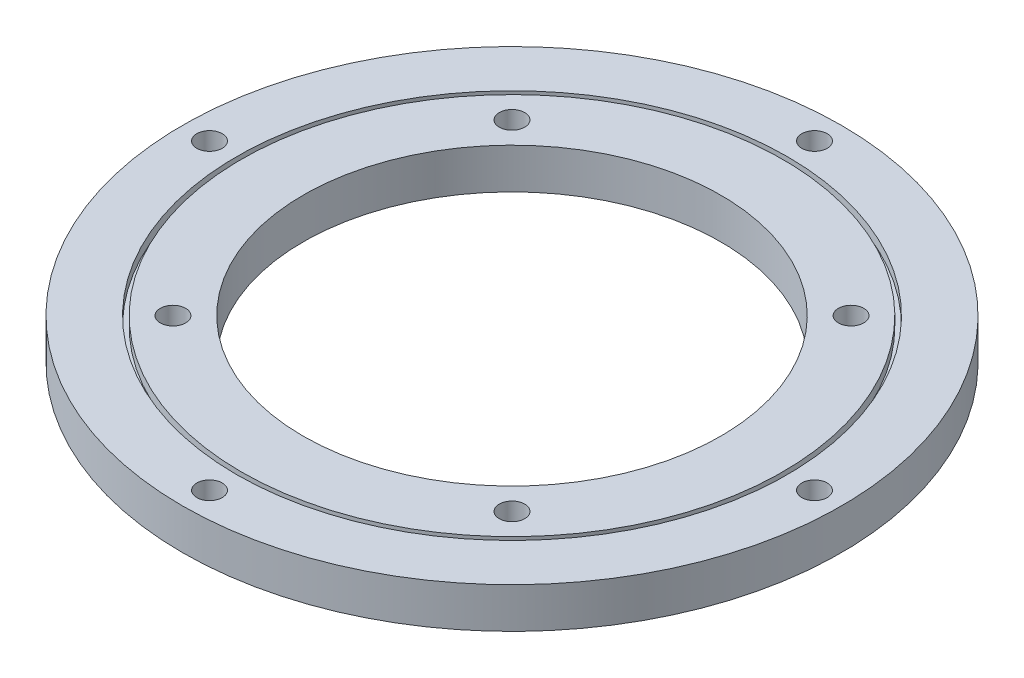
ISO-10303-21;
HEADER;
FILE_DESCRIPTION(('STEP AP214'),'2;1');
FILE_NAME('part.step','',(''),(''),'','','');
FILE_SCHEMA(('AUTOMOTIVE_DESIGN { 1 0 10303 214 1 1 1 1 }'));
ENDSEC;
DATA;
#1=APPLICATION_CONTEXT('core data for automotive mechanical design processes');
#2=APPLICATION_PROTOCOL_DEFINITION('international standard','automotive_design',2000,#1);
#3=PRODUCT_CONTEXT('',#1,'mechanical');
#4=PRODUCT('Part','Part','',(#3));
#5=PRODUCT_RELATED_PRODUCT_CATEGORY('part','',(#4));
#6=PRODUCT_DEFINITION_FORMATION('','',#4);
#7=PRODUCT_DEFINITION_CONTEXT('part definition',#1,'design');
#8=PRODUCT_DEFINITION('design','',#6,#7);
#9=PRODUCT_DEFINITION_SHAPE('','',#8);
#10=(LENGTH_UNIT() NAMED_UNIT(*) SI_UNIT(.MILLI.,.METRE.));
#11=(NAMED_UNIT(*) PLANE_ANGLE_UNIT() SI_UNIT($,.RADIAN.));
#12=(NAMED_UNIT(*) SI_UNIT($,.STERADIAN.) SOLID_ANGLE_UNIT());
#13=UNCERTAINTY_MEASURE_WITH_UNIT(LENGTH_MEASURE(1.E-05),#10,'distance_accuracy_value','');
#14=(GEOMETRIC_REPRESENTATION_CONTEXT(3) GLOBAL_UNCERTAINTY_ASSIGNED_CONTEXT((#13)) GLOBAL_UNIT_ASSIGNED_CONTEXT((#10,
#11,#12)) REPRESENTATION_CONTEXT('',''));
#15=CARTESIAN_POINT('',(0.,0.,0.));
#16=DIRECTION('',(0.,0.,1.));
#17=DIRECTION('',(1.,0.,0.));
#18=AXIS2_PLACEMENT_3D('',#15,#16,#17);
#19=CARTESIAN_POINT('',(0.,0.,0.));
#20=DIRECTION('',(0.,1.,0.));
#21=DIRECTION('',(0.,0.,1.));
#22=AXIS2_PLACEMENT_3D('',#19,#20,#21);
#23=PLANE('',#22);
#24=CARTESIAN_POINT('',(-36.0094128319228,0.,36.009412831925));
#25=DIRECTION('',(0.,1.,0.));
#26=DIRECTION('',(0.,0.,1.));
#27=AXIS2_PLACEMENT_3D('',#24,#25,#26);
#28=CIRCLE('',#27,2.70000000000106);
#29=CARTESIAN_POINT('',(-36.0094128319228,0.,38.7094128319261));
#30=VERTEX_POINT('',#29);
#31=EDGE_CURVE('E115',#30,#30,#28,.T.);
#32=ORIENTED_EDGE('',*,*,#31,.T.);
#33=EDGE_LOOP('',(#32));
#34=FACE_BOUND('',#33,.T.);
#35=CARTESIAN_POINT('',(36.009412831927,0.,36.0094128319229));
#36=DIRECTION('',(0.,1.,0.));
#37=DIRECTION('',(0.,0.,1.));
#38=AXIS2_PLACEMENT_3D('',#35,#36,#37);
#39=CIRCLE('',#38,2.70000000000282);
#40=CARTESIAN_POINT('',(36.009412831927,0.,38.7094128319257));
#41=VERTEX_POINT('',#40);
#42=EDGE_CURVE('E121',#41,#41,#39,.T.);
#43=ORIENTED_EDGE('',*,*,#42,.T.);
#44=EDGE_LOOP('',(#43));
#45=FACE_BOUND('',#44,.T.);
#46=CARTESIAN_POINT('',(36.0094128319249,0.,-36.009412831927));
#47=DIRECTION('',(0.,1.,0.));
#48=DIRECTION('',(0.,0.,1.));
#49=AXIS2_PLACEMENT_3D('',#46,#47,#48);
#50=CIRCLE('',#49,2.70000000000207);
#51=CARTESIAN_POINT('',(36.0094128319249,0.,-33.3094128319249));
#52=VERTEX_POINT('',#51);
#53=EDGE_CURVE('E127',#52,#52,#50,.T.);
#54=ORIENTED_EDGE('',*,*,#53,.T.);
#55=EDGE_LOOP('',(#54));
#56=FACE_BOUND('',#55,.T.);
#57=CARTESIAN_POINT('',(-36.009412831925,0.,-36.0094128319249));
#58=DIRECTION('',(0.,1.,0.));
#59=DIRECTION('',(0.,0.,1.));
#60=AXIS2_PLACEMENT_3D('',#57,#58,#59);
#61=CIRCLE('',#60,2.7);
#62=CARTESIAN_POINT('',(-36.009412831925,0.,-33.3094128319249));
#63=VERTEX_POINT('',#62);
#64=EDGE_CURVE('E89',#63,#63,#61,.T.);
#65=ORIENTED_EDGE('',*,*,#64,.T.);
#66=EDGE_LOOP('',(#65));
#67=FACE_BOUND('',#66,.T.);
#68=CARTESIAN_POINT('',(0.,0.,0.));
#69=DIRECTION('',(0.,1.,0.));
#70=DIRECTION('',(0.,0.,1.));
#71=AXIS2_PLACEMENT_3D('',#68,#69,#70);
#72=CIRCLE('',#71,44.35);
#73=CARTESIAN_POINT('',(0.,0.,44.35));
#74=VERTEX_POINT('',#73);
#75=EDGE_CURVE('E55',#74,#74,#72,.T.);
#76=ORIENTED_EDGE('',*,*,#75,.T.);
#77=EDGE_LOOP('',(#76));
#78=FACE_BOUND('',#77,.T.);
#79=CARTESIAN_POINT('',(0.,0.,0.));
#80=DIRECTION('',(0.,1.,0.));
#81=DIRECTION('',(0.,0.,1.));
#82=AXIS2_PLACEMENT_3D('',#79,#80,#81);
#83=CIRCLE('',#82,57.5);
#84=CARTESIAN_POINT('',(0.,0.,57.5));
#85=VERTEX_POINT('',#84);
#86=EDGE_CURVE('E79',#85,#85,#83,.T.);
#87=ORIENTED_EDGE('',*,*,#86,.F.);
#88=EDGE_LOOP('',(#87));
#89=FACE_BOUND('',#88,.T.);
#90=ADVANCED_FACE('F42',(#34,#45,#56,#67,#78,#89),#23,.F.);
#91=CARTESIAN_POINT('',(0.,8.6,0.));
#92=DIRECTION('',(0.,1.,0.));
#93=DIRECTION('',(0.,0.,1.));
#94=AXIS2_PLACEMENT_3D('',#91,#92,#93);
#95=PLANE('',#94);
#96=CARTESIAN_POINT('',(-36.0094128319228,8.6,36.009412831925));
#97=DIRECTION('',(0.,1.,0.));
#98=DIRECTION('',(0.,0.,1.));
#99=AXIS2_PLACEMENT_3D('',#96,#97,#98);
#100=CIRCLE('',#99,2.70000000000106);
#101=CARTESIAN_POINT('',(-36.0094128319228,8.6,38.7094128319261));
#102=VERTEX_POINT('',#101);
#103=EDGE_CURVE('E118',#102,#102,#100,.T.);
#104=ORIENTED_EDGE('',*,*,#103,.F.);
#105=EDGE_LOOP('',(#104));
#106=FACE_BOUND('',#105,.T.);
#107=CARTESIAN_POINT('',(36.009412831927,8.6,36.0094128319229));
#108=DIRECTION('',(0.,1.,0.));
#109=DIRECTION('',(0.,0.,1.));
#110=AXIS2_PLACEMENT_3D('',#107,#108,#109);
#111=CIRCLE('',#110,2.70000000000282);
#112=CARTESIAN_POINT('',(36.009412831927,8.6,38.7094128319257));
#113=VERTEX_POINT('',#112);
#114=EDGE_CURVE('E124',#113,#113,#111,.T.);
#115=ORIENTED_EDGE('',*,*,#114,.F.);
#116=EDGE_LOOP('',(#115));
#117=FACE_BOUND('',#116,.T.);
#118=CARTESIAN_POINT('',(36.0094128319249,8.6,-36.009412831927));
#119=DIRECTION('',(0.,1.,0.));
#120=DIRECTION('',(0.,0.,1.));
#121=AXIS2_PLACEMENT_3D('',#118,#119,#120);
#122=CIRCLE('',#121,2.70000000000207);
#123=CARTESIAN_POINT('',(36.0094128319249,8.6,-33.3094128319249));
#124=VERTEX_POINT('',#123);
#125=EDGE_CURVE('E112',#124,#124,#122,.T.);
#126=ORIENTED_EDGE('',*,*,#125,.F.);
#127=EDGE_LOOP('',(#126));
#128=FACE_BOUND('',#127,.T.);
#129=CARTESIAN_POINT('',(-36.009412831925,8.6,-36.0094128319249));
#130=DIRECTION('',(0.,1.,0.));
#131=DIRECTION('',(0.,0.,1.));
#132=AXIS2_PLACEMENT_3D('',#129,#130,#131);
#133=CIRCLE('',#132,2.7);
#134=CARTESIAN_POINT('',(-36.009412831925,8.6,-33.3094128319249));
#135=VERTEX_POINT('',#134);
#136=EDGE_CURVE('E109',#135,#135,#133,.T.);
#137=ORIENTED_EDGE('',*,*,#136,.F.);
#138=EDGE_LOOP('',(#137));
#139=FACE_BOUND('',#138,.T.);
#140=CARTESIAN_POINT('',(0.,8.6,0.));
#141=DIRECTION('',(0.,1.,0.));
#142=DIRECTION('',(0.,0.,1.));
#143=AXIS2_PLACEMENT_3D('',#140,#141,#142);
#144=CIRCLE('',#143,44.35);
#145=CARTESIAN_POINT('',(0.,8.6,44.35));
#146=VERTEX_POINT('',#145);
#147=EDGE_CURVE('E53',#146,#146,#144,.T.);
#148=ORIENTED_EDGE('',*,*,#147,.F.);
#149=EDGE_LOOP('',(#148));
#150=FACE_BOUND('',#149,.T.);
#151=CARTESIAN_POINT('',(0.,8.6,0.));
#152=DIRECTION('',(0.,1.,0.));
#153=DIRECTION('',(0.,0.,1.));
#154=AXIS2_PLACEMENT_3D('',#151,#152,#153);
#155=CIRCLE('',#154,57.5);
#156=CARTESIAN_POINT('',(0.,8.6,57.5));
#157=VERTEX_POINT('',#156);
#158=EDGE_CURVE('E67',#157,#157,#155,.T.);
#159=ORIENTED_EDGE('',*,*,#158,.T.);
#160=EDGE_LOOP('',(#159));
#161=FACE_BOUND('',#160,.T.);
#162=ADVANCED_FACE('F135',(#106,#117,#128,#139,#150,#161),#95,.T.);
#163=CARTESIAN_POINT('',(0.,8.6,-64.25));
#164=DIRECTION('',(0.,1.,0.));
#165=DIRECTION('',(0.,0.,1.));
#166=AXIS2_PLACEMENT_3D('',#163,#164,#165);
#167=CIRCLE('',#166,2.7);
#168=CARTESIAN_POINT('',(0.,8.6,-61.55));
#169=VERTEX_POINT('',#168);
#170=EDGE_CURVE('E104',#169,#169,#167,.T.);
#171=ORIENTED_EDGE('',*,*,#170,.F.);
#172=EDGE_LOOP('',(#171));
#173=FACE_BOUND('',#172,.T.);
#174=CARTESIAN_POINT('',(64.2500000000018,8.6,-1.81358812546716E-12));
#175=DIRECTION('',(0.,1.,0.));
#176=DIRECTION('',(0.,0.,1.));
#177=AXIS2_PLACEMENT_3D('',#174,#175,#176);
#178=CIRCLE('',#177,2.70000000000141);
#179=CARTESIAN_POINT('',(64.2500000000018,8.6,2.6999999999996));
#180=VERTEX_POINT('',#179);
#181=EDGE_CURVE('E101',#180,#180,#178,.T.);
#182=ORIENTED_EDGE('',*,*,#181,.F.);
#183=EDGE_LOOP('',(#182));
#184=FACE_BOUND('',#183,.T.);
#185=CARTESIAN_POINT('',(3.62788042284384E-12,8.6,64.25));
#186=DIRECTION('',(0.,1.,0.));
#187=DIRECTION('',(0.,0.,1.));
#188=AXIS2_PLACEMENT_3D('',#185,#186,#187);
#189=CIRCLE('',#188,2.7000000000039);
#190=CARTESIAN_POINT('',(3.62788042284384E-12,8.6,66.9500000000039));
#191=VERTEX_POINT('',#190);
#192=EDGE_CURVE('E95',#191,#191,#189,.T.);
#193=ORIENTED_EDGE('',*,*,#192,.F.);
#194=EDGE_LOOP('',(#193));
#195=FACE_BOUND('',#194,.T.);
#196=CARTESIAN_POINT('',(-64.2499999999982,8.6,1.82145648115169E-12));
#197=DIRECTION('',(0.,1.,0.));
#198=DIRECTION('',(0.,0.,1.));
#199=AXIS2_PLACEMENT_3D('',#196,#197,#198);
#200=CIRCLE('',#199,2.70000000000291);
#201=CARTESIAN_POINT('',(-64.2499999999982,8.6,2.70000000000473));
#202=VERTEX_POINT('',#201);
#203=EDGE_CURVE('E88',#202,#202,#200,.T.);
#204=ORIENTED_EDGE('',*,*,#203,.F.);
#205=EDGE_LOOP('',(#204));
#206=FACE_BOUND('',#205,.T.);
#207=CARTESIAN_POINT('',(0.,8.6,0.));
#208=DIRECTION('',(0.,1.,0.));
#209=DIRECTION('',(0.,0.,1.));
#210=AXIS2_PLACEMENT_3D('',#207,#208,#209);
#211=CIRCLE('',#210,58.5);
#212=CARTESIAN_POINT('',(0.,8.6,58.5));
#213=VERTEX_POINT('',#212);
#214=EDGE_CURVE('E61',#213,#213,#211,.T.);
#215=ORIENTED_EDGE('',*,*,#214,.F.);
#216=EDGE_LOOP('',(#215));
#217=FACE_BOUND('',#216,.T.);
#218=CARTESIAN_POINT('',(0.,8.6,0.));
#219=DIRECTION('',(0.,1.,0.));
#220=DIRECTION('',(0.,0.,1.));
#221=AXIS2_PLACEMENT_3D('',#218,#219,#220);
#222=CIRCLE('',#221,70.);
#223=CARTESIAN_POINT('',(0.,8.6,70.));
#224=VERTEX_POINT('',#223);
#225=EDGE_CURVE('E10',#224,#224,#222,.T.);
#226=ORIENTED_EDGE('',*,*,#225,.T.);
#227=EDGE_LOOP('',(#226));
#228=FACE_BOUND('',#227,.T.);
#229=ADVANCED_FACE('F138',(#173,#184,#195,#206,#217,#228),#95,.T.);
#230=CARTESIAN_POINT('',(0.,0.,-64.25));
#231=DIRECTION('',(0.,1.,0.));
#232=DIRECTION('',(0.,0.,1.));
#233=AXIS2_PLACEMENT_3D('',#230,#231,#232);
#234=CIRCLE('',#233,2.7);
#235=CARTESIAN_POINT('',(0.,0.,-61.55));
#236=VERTEX_POINT('',#235);
#237=EDGE_CURVE('E82',#236,#236,#234,.T.);
#238=ORIENTED_EDGE('',*,*,#237,.T.);
#239=EDGE_LOOP('',(#238));
#240=FACE_BOUND('',#239,.T.);
#241=CARTESIAN_POINT('',(64.2500000000018,0.,-1.81358812546716E-12));
#242=DIRECTION('',(0.,1.,0.));
#243=DIRECTION('',(0.,0.,1.));
#244=AXIS2_PLACEMENT_3D('',#241,#242,#243);
#245=CIRCLE('',#244,2.70000000000141);
#246=CARTESIAN_POINT('',(64.2500000000018,0.,2.6999999999996));
#247=VERTEX_POINT('',#246);
#248=EDGE_CURVE('E98',#247,#247,#245,.T.);
#249=ORIENTED_EDGE('',*,*,#248,.T.);
#250=EDGE_LOOP('',(#249));
#251=FACE_BOUND('',#250,.T.);
#252=CARTESIAN_POINT('',(3.62788042284384E-12,0.,64.25));
#253=DIRECTION('',(0.,1.,0.));
#254=DIRECTION('',(0.,0.,1.));
#255=AXIS2_PLACEMENT_3D('',#252,#253,#254);
#256=CIRCLE('',#255,2.7000000000039);
#257=CARTESIAN_POINT('',(3.62788042284384E-12,0.,66.9500000000039));
#258=VERTEX_POINT('',#257);
#259=EDGE_CURVE('E92',#258,#258,#256,.T.);
#260=ORIENTED_EDGE('',*,*,#259,.T.);
#261=EDGE_LOOP('',(#260));
#262=FACE_BOUND('',#261,.T.);
#263=CARTESIAN_POINT('',(-64.2499999999982,0.,1.82145648115169E-12));
#264=DIRECTION('',(0.,1.,0.));
#265=DIRECTION('',(0.,0.,1.));
#266=AXIS2_PLACEMENT_3D('',#263,#264,#265);
#267=CIRCLE('',#266,2.70000000000291);
#268=CARTESIAN_POINT('',(-64.2499999999982,0.,2.70000000000473));
#269=VERTEX_POINT('',#268);
#270=EDGE_CURVE('E85',#269,#269,#267,.T.);
#271=ORIENTED_EDGE('',*,*,#270,.T.);
#272=EDGE_LOOP('',(#271));
#273=FACE_BOUND('',#272,.T.);
#274=CARTESIAN_POINT('',(0.,0.,0.));
#275=DIRECTION('',(0.,1.,0.));
#276=DIRECTION('',(0.,0.,1.));
#277=AXIS2_PLACEMENT_3D('',#274,#275,#276);
#278=CIRCLE('',#277,58.5);
#279=CARTESIAN_POINT('',(0.,0.,58.5));
#280=VERTEX_POINT('',#279);
#281=EDGE_CURVE('E73',#280,#280,#278,.T.);
#282=ORIENTED_EDGE('',*,*,#281,.T.);
#283=EDGE_LOOP('',(#282));
#284=FACE_BOUND('',#283,.T.);
#285=CARTESIAN_POINT('',(0.,0.,0.));
#286=DIRECTION('',(0.,1.,0.));
#287=DIRECTION('',(0.,0.,1.));
#288=AXIS2_PLACEMENT_3D('',#285,#286,#287);
#289=CIRCLE('',#288,70.);
#290=CARTESIAN_POINT('',(0.,0.,70.));
#291=VERTEX_POINT('',#290);
#292=EDGE_CURVE('E46',#291,#291,#289,.T.);
#293=ORIENTED_EDGE('',*,*,#292,.F.);
#294=EDGE_LOOP('',(#293));
#295=FACE_BOUND('',#294,.T.);
#296=ADVANCED_FACE('F166',(#240,#251,#262,#273,#284,#295),#23,.F.);
#297=CARTESIAN_POINT('',(0.,8.6,0.));
#298=DIRECTION('',(0.,-1.,0.));
#299=DIRECTION('',(0.,0.,-1.));
#300=AXIS2_PLACEMENT_3D('',#297,#298,#299);
#301=CYLINDRICAL_SURFACE('',#300,70.);
#302=ORIENTED_EDGE('',*,*,#225,.F.);
#303=EDGE_LOOP('',(#302));
#304=FACE_BOUND('',#303,.T.);
#305=ORIENTED_EDGE('',*,*,#292,.T.);
#306=EDGE_LOOP('',(#305));
#307=FACE_BOUND('',#306,.T.);
#308=ADVANCED_FACE('F44',(#304,#307),#301,.T.);
#309=CARTESIAN_POINT('',(0.,8.6,0.));
#310=DIRECTION('',(0.,-1.,0.));
#311=DIRECTION('',(0.,0.,-1.));
#312=AXIS2_PLACEMENT_3D('',#309,#310,#311);
#313=CYLINDRICAL_SURFACE('',#312,44.35);
#314=ORIENTED_EDGE('',*,*,#147,.T.);
#315=EDGE_LOOP('',(#314));
#316=FACE_BOUND('',#315,.T.);
#317=ORIENTED_EDGE('',*,*,#75,.F.);
#318=EDGE_LOOP('',(#317));
#319=FACE_BOUND('',#318,.T.);
#320=ADVANCED_FACE('F176',(#316,#319),#313,.F.);
#321=CARTESIAN_POINT('',(0.,6.6,0.));
#322=DIRECTION('',(0.,1.,0.));
#323=DIRECTION('',(0.,0.,1.));
#324=AXIS2_PLACEMENT_3D('',#321,#322,#323);
#325=CYLINDRICAL_SURFACE('',#324,58.5);
#326=CARTESIAN_POINT('',(0.,6.6,0.));
#327=DIRECTION('',(0.,1.,0.));
#328=DIRECTION('',(0.,0.,1.));
#329=AXIS2_PLACEMENT_3D('',#326,#327,#328);
#330=CIRCLE('',#329,58.5);
#331=CARTESIAN_POINT('',(0.,6.6,58.5));
#332=VERTEX_POINT('',#331);
#333=EDGE_CURVE('E58',#332,#332,#330,.T.);
#334=ORIENTED_EDGE('',*,*,#333,.F.);
#335=EDGE_LOOP('',(#334));
#336=FACE_BOUND('',#335,.T.);
#337=ORIENTED_EDGE('',*,*,#214,.T.);
#338=EDGE_LOOP('',(#337));
#339=FACE_BOUND('',#338,.T.);
#340=ADVANCED_FACE('F160',(#336,#339),#325,.F.);
#341=CARTESIAN_POINT('',(0.,6.6,0.));
#342=DIRECTION('',(0.,1.,0.));
#343=DIRECTION('',(0.,0.,1.));
#344=AXIS2_PLACEMENT_3D('',#341,#342,#343);
#345=PLANE('',#344);
#346=CARTESIAN_POINT('',(0.,6.6,0.));
#347=DIRECTION('',(0.,1.,0.));
#348=DIRECTION('',(0.,0.,1.));
#349=AXIS2_PLACEMENT_3D('',#346,#347,#348);
#350=CIRCLE('',#349,57.5);
#351=CARTESIAN_POINT('',(0.,6.6,57.5));
#352=VERTEX_POINT('',#351);
#353=EDGE_CURVE('E64',#352,#352,#350,.T.);
#354=ORIENTED_EDGE('',*,*,#353,.F.);
#355=EDGE_LOOP('',(#354));
#356=FACE_BOUND('',#355,.T.);
#357=ORIENTED_EDGE('',*,*,#333,.T.);
#358=EDGE_LOOP('',(#357));
#359=FACE_BOUND('',#358,.T.);
#360=ADVANCED_FACE('F150',(#356,#359),#345,.T.);
#361=CARTESIAN_POINT('',(0.,6.6,0.));
#362=DIRECTION('',(0.,1.,0.));
#363=DIRECTION('',(0.,0.,1.));
#364=AXIS2_PLACEMENT_3D('',#361,#362,#363);
#365=CYLINDRICAL_SURFACE('',#364,57.5);
#366=ORIENTED_EDGE('',*,*,#353,.T.);
#367=EDGE_LOOP('',(#366));
#368=FACE_BOUND('',#367,.T.);
#369=ORIENTED_EDGE('',*,*,#158,.F.);
#370=EDGE_LOOP('',(#369));
#371=FACE_BOUND('',#370,.T.);
#372=ADVANCED_FACE('F147',(#368,#371),#365,.T.);
#373=CARTESIAN_POINT('',(0.,2.,0.));
#374=DIRECTION('',(0.,-1.,0.));
#375=DIRECTION('',(0.,0.,1.));
#376=AXIS2_PLACEMENT_3D('',#373,#374,#375);
#377=PLANE('',#376);
#378=CARTESIAN_POINT('',(0.,2.,0.));
#379=DIRECTION('',(0.,1.,0.));
#380=DIRECTION('',(0.,0.,1.));
#381=AXIS2_PLACEMENT_3D('',#378,#379,#380);
#382=CIRCLE('',#381,58.5);
#383=CARTESIAN_POINT('',(0.,2.,58.5));
#384=VERTEX_POINT('',#383);
#385=EDGE_CURVE('E70',#384,#384,#382,.T.);
#386=ORIENTED_EDGE('',*,*,#385,.F.);
#387=EDGE_LOOP('',(#386));
#388=FACE_BOUND('',#387,.T.);
#389=CARTESIAN_POINT('',(0.,2.,0.));
#390=DIRECTION('',(0.,1.,0.));
#391=DIRECTION('',(0.,0.,1.));
#392=AXIS2_PLACEMENT_3D('',#389,#390,#391);
#393=CIRCLE('',#392,57.5);
#394=CARTESIAN_POINT('',(0.,2.,57.5));
#395=VERTEX_POINT('',#394);
#396=EDGE_CURVE('E76',#395,#395,#393,.T.);
#397=ORIENTED_EDGE('',*,*,#396,.T.);
#398=EDGE_LOOP('',(#397));
#399=FACE_BOUND('',#398,.T.);
#400=ADVANCED_FACE('F149',(#388,#399),#377,.T.);
#401=CARTESIAN_POINT('',(0.,2.,0.));
#402=DIRECTION('',(0.,-1.,0.));
#403=DIRECTION('',(0.,0.,-1.));
#404=AXIS2_PLACEMENT_3D('',#401,#402,#403);
#405=CYLINDRICAL_SURFACE('',#404,58.5);
#406=ORIENTED_EDGE('',*,*,#385,.T.);
#407=EDGE_LOOP('',(#406));
#408=FACE_BOUND('',#407,.T.);
#409=ORIENTED_EDGE('',*,*,#281,.F.);
#410=EDGE_LOOP('',(#409));
#411=FACE_BOUND('',#410,.T.);
#412=ADVANCED_FACE('F157',(#408,#411),#405,.F.);
#413=CARTESIAN_POINT('',(0.,2.,0.));
#414=DIRECTION('',(0.,-1.,0.));
#415=DIRECTION('',(0.,0.,-1.));
#416=AXIS2_PLACEMENT_3D('',#413,#414,#415);
#417=CYLINDRICAL_SURFACE('',#416,57.5);
#418=ORIENTED_EDGE('',*,*,#396,.F.);
#419=EDGE_LOOP('',(#418));
#420=FACE_BOUND('',#419,.T.);
#421=ORIENTED_EDGE('',*,*,#86,.T.);
#422=EDGE_LOOP('',(#421));
#423=FACE_BOUND('',#422,.T.);
#424=ADVANCED_FACE('F193',(#420,#423),#417,.T.);
#425=CARTESIAN_POINT('',(-64.2499999999982,0.,1.82145648115169E-12));
#426=DIRECTION('',(0.,1.,0.));
#427=DIRECTION('',(0.,0.,1.));
#428=AXIS2_PLACEMENT_3D('',#425,#426,#427);
#429=CYLINDRICAL_SURFACE('',#428,2.70000000000291);
#430=ORIENTED_EDGE('',*,*,#270,.F.);
#431=EDGE_LOOP('',(#430));
#432=FACE_BOUND('',#431,.T.);
#433=ORIENTED_EDGE('',*,*,#203,.T.);
#434=EDGE_LOOP('',(#433));
#435=FACE_BOUND('',#434,.T.);
#436=ADVANCED_FACE('F198',(#432,#435),#429,.F.);
#437=CARTESIAN_POINT('',(3.62788042284384E-12,0.,64.25));
#438=DIRECTION('',(0.,1.,0.));
#439=DIRECTION('',(0.,0.,1.));
#440=AXIS2_PLACEMENT_3D('',#437,#438,#439);
#441=CYLINDRICAL_SURFACE('',#440,2.7000000000039);
#442=ORIENTED_EDGE('',*,*,#259,.F.);
#443=EDGE_LOOP('',(#442));
#444=FACE_BOUND('',#443,.T.);
#445=ORIENTED_EDGE('',*,*,#192,.T.);
#446=EDGE_LOOP('',(#445));
#447=FACE_BOUND('',#446,.T.);
#448=ADVANCED_FACE('F204',(#444,#447),#441,.F.);
#449=CARTESIAN_POINT('',(64.2500000000018,0.,-1.81358812546716E-12));
#450=DIRECTION('',(0.,1.,0.));
#451=DIRECTION('',(0.,0.,1.));
#452=AXIS2_PLACEMENT_3D('',#449,#450,#451);
#453=CYLINDRICAL_SURFACE('',#452,2.70000000000141);
#454=ORIENTED_EDGE('',*,*,#248,.F.);
#455=EDGE_LOOP('',(#454));
#456=FACE_BOUND('',#455,.T.);
#457=ORIENTED_EDGE('',*,*,#181,.T.);
#458=EDGE_LOOP('',(#457));
#459=FACE_BOUND('',#458,.T.);
#460=ADVANCED_FACE('F208',(#456,#459),#453,.F.);
#461=CARTESIAN_POINT('',(0.,0.,-64.25));
#462=DIRECTION('',(0.,1.,0.));
#463=DIRECTION('',(0.,0.,1.));
#464=AXIS2_PLACEMENT_3D('',#461,#462,#463);
#465=CYLINDRICAL_SURFACE('',#464,2.7);
#466=ORIENTED_EDGE('',*,*,#237,.F.);
#467=EDGE_LOOP('',(#466));
#468=FACE_BOUND('',#467,.T.);
#469=ORIENTED_EDGE('',*,*,#170,.T.);
#470=EDGE_LOOP('',(#469));
#471=FACE_BOUND('',#470,.T.);
#472=ADVANCED_FACE('F212',(#468,#471),#465,.F.);
#473=CARTESIAN_POINT('',(-36.009412831925,0.,-36.0094128319249));
#474=DIRECTION('',(0.,1.,0.));
#475=DIRECTION('',(0.,0.,1.));
#476=AXIS2_PLACEMENT_3D('',#473,#474,#475);
#477=CYLINDRICAL_SURFACE('',#476,2.7);
#478=ORIENTED_EDGE('',*,*,#64,.F.);
#479=EDGE_LOOP('',(#478));
#480=FACE_BOUND('',#479,.T.);
#481=ORIENTED_EDGE('',*,*,#136,.T.);
#482=EDGE_LOOP('',(#481));
#483=FACE_BOUND('',#482,.T.);
#484=ADVANCED_FACE('F216',(#480,#483),#477,.F.);
#485=CARTESIAN_POINT('',(36.0094128319249,0.,-36.009412831927));
#486=DIRECTION('',(0.,1.,0.));
#487=DIRECTION('',(0.,0.,1.));
#488=AXIS2_PLACEMENT_3D('',#485,#486,#487);
#489=CYLINDRICAL_SURFACE('',#488,2.70000000000207);
#490=ORIENTED_EDGE('',*,*,#53,.F.);
#491=EDGE_LOOP('',(#490));
#492=FACE_BOUND('',#491,.T.);
#493=ORIENTED_EDGE('',*,*,#125,.T.);
#494=EDGE_LOOP('',(#493));
#495=FACE_BOUND('',#494,.T.);
#496=ADVANCED_FACE('F133',(#492,#495),#489,.F.);
#497=CARTESIAN_POINT('',(36.009412831927,0.,36.0094128319229));
#498=DIRECTION('',(0.,1.,0.));
#499=DIRECTION('',(0.,0.,1.));
#500=AXIS2_PLACEMENT_3D('',#497,#498,#499);
#501=CYLINDRICAL_SURFACE('',#500,2.70000000000282);
#502=ORIENTED_EDGE('',*,*,#42,.F.);
#503=EDGE_LOOP('',(#502));
#504=FACE_BOUND('',#503,.T.);
#505=ORIENTED_EDGE('',*,*,#114,.T.);
#506=EDGE_LOOP('',(#505));
#507=FACE_BOUND('',#506,.T.);
#508=ADVANCED_FACE('F224',(#504,#507),#501,.F.);
#509=CARTESIAN_POINT('',(-36.0094128319228,0.,36.009412831925));
#510=DIRECTION('',(0.,1.,0.));
#511=DIRECTION('',(0.,0.,1.));
#512=AXIS2_PLACEMENT_3D('',#509,#510,#511);
#513=CYLINDRICAL_SURFACE('',#512,2.70000000000106);
#514=ORIENTED_EDGE('',*,*,#31,.F.);
#515=EDGE_LOOP('',(#514));
#516=FACE_BOUND('',#515,.T.);
#517=ORIENTED_EDGE('',*,*,#103,.T.);
#518=EDGE_LOOP('',(#517));
#519=FACE_BOUND('',#518,.T.);
#520=ADVANCED_FACE('F221',(#516,#519),#513,.F.);
#521=CLOSED_SHELL('',(#90,#162,#229,#296,#308,#320,#340,#360,#372,#400,#412,#424,#436,#448,#460,
#472,#484,#496,#508,#520));
#522=MANIFOLD_SOLID_BREP('B2',#521);
#523=ADVANCED_BREP_SHAPE_REPRESENTATION('',(#18,#522),#14);
#524=SHAPE_DEFINITION_REPRESENTATION(#9,#523);
ENDSEC;
END-ISO-10303-21;
